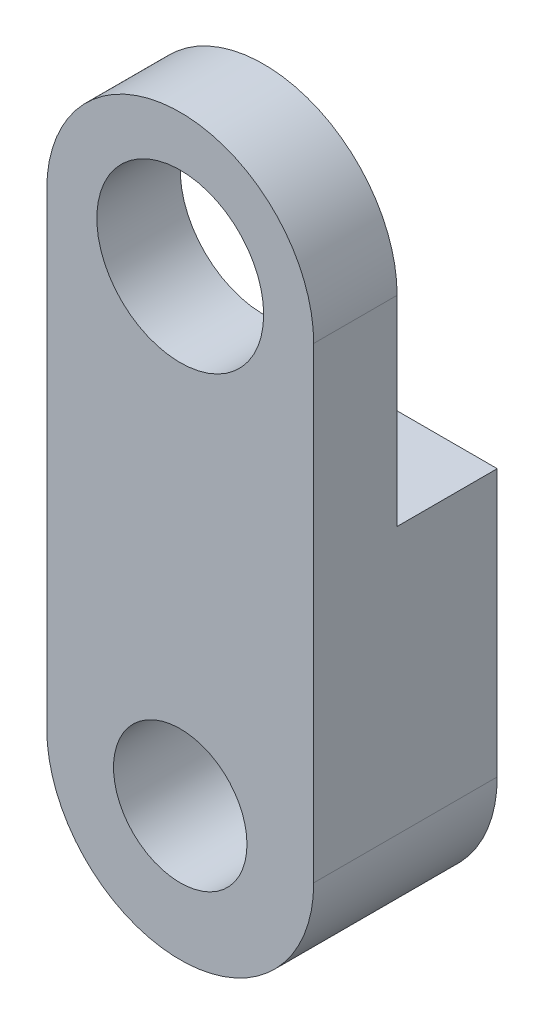
ISO-10303-21;
HEADER;
FILE_DESCRIPTION(('STEP AP214'),'2;1');
FILE_NAME('part.step','',(''),(''),'','','');
FILE_SCHEMA(('AUTOMOTIVE_DESIGN { 1 0 10303 214 1 1 1 1 }'));
ENDSEC;
DATA;
#1=APPLICATION_CONTEXT('core data for automotive mechanical design processes');
#2=APPLICATION_PROTOCOL_DEFINITION('international standard','automotive_design',2000,#1);
#3=PRODUCT_CONTEXT('',#1,'mechanical');
#4=PRODUCT('Part','Part','',(#3));
#5=PRODUCT_RELATED_PRODUCT_CATEGORY('part','',(#4));
#6=PRODUCT_DEFINITION_FORMATION('','',#4);
#7=PRODUCT_DEFINITION_CONTEXT('part definition',#1,'design');
#8=PRODUCT_DEFINITION('design','',#6,#7);
#9=PRODUCT_DEFINITION_SHAPE('','',#8);
#10=(LENGTH_UNIT() NAMED_UNIT(*) SI_UNIT(.MILLI.,.METRE.));
#11=(NAMED_UNIT(*) PLANE_ANGLE_UNIT() SI_UNIT($,.RADIAN.));
#12=(NAMED_UNIT(*) SI_UNIT($,.STERADIAN.) SOLID_ANGLE_UNIT());
#13=UNCERTAINTY_MEASURE_WITH_UNIT(LENGTH_MEASURE(1.E-05),#10,'distance_accuracy_value','');
#14=(GEOMETRIC_REPRESENTATION_CONTEXT(3) GLOBAL_UNCERTAINTY_ASSIGNED_CONTEXT((#13)) GLOBAL_UNIT_ASSIGNED_CONTEXT((#10,
#11,#12)) REPRESENTATION_CONTEXT('',''));
#15=CARTESIAN_POINT('',(0.,0.,0.));
#16=DIRECTION('',(0.,0.,1.));
#17=DIRECTION('',(1.,0.,0.));
#18=AXIS2_PLACEMENT_3D('',#15,#16,#17);
#19=CARTESIAN_POINT('',(0.,-7.,5.5));
#20=DIRECTION('',(0.,0.,1.));
#21=DIRECTION('',(1.,0.,0.));
#22=AXIS2_PLACEMENT_3D('',#19,#20,#21);
#23=PLANE('',#22);
#24=CARTESIAN_POINT('',(0.,-7.,5.5));
#25=DIRECTION('',(0.,0.,1.));
#26=DIRECTION('',(1.,0.,0.));
#27=AXIS2_PLACEMENT_3D('',#24,#25,#26);
#28=CIRCLE('',#27,2.);
#29=CARTESIAN_POINT('',(2.,-7.,5.5));
#30=VERTEX_POINT('',#29);
#31=EDGE_CURVE('E123',#30,#30,#28,.T.);
#32=ORIENTED_EDGE('',*,*,#31,.F.);
#33=EDGE_LOOP('',(#32));
#34=FACE_BOUND('',#33,.T.);
#35=CARTESIAN_POINT('',(0.,-7.,5.5));
#36=DIRECTION('',(0.,0.,1.));
#37=DIRECTION('',(1.,0.,0.));
#38=AXIS2_PLACEMENT_3D('',#35,#36,#37);
#39=CIRCLE('',#38,4.);
#40=CARTESIAN_POINT('',(-4.,-7.,5.5));
#41=VERTEX_POINT('',#40);
#42=CARTESIAN_POINT('',(4.,-7.,5.5));
#43=VERTEX_POINT('',#42);
#44=EDGE_CURVE('E129',#41,#43,#39,.T.);
#45=ORIENTED_EDGE('',*,*,#44,.T.);
#46=DIRECTION('',(0.,1.,0.));
#47=VECTOR('',#46,1.);
#48=CARTESIAN_POINT('',(4.,-7.,5.5));
#49=LINE('',#48,#47);
#50=CARTESIAN_POINT('',(4.,7.,5.5));
#51=VERTEX_POINT('',#50);
#52=EDGE_CURVE('E79',#43,#51,#49,.T.);
#53=ORIENTED_EDGE('',*,*,#52,.T.);
#54=CARTESIAN_POINT('',(0.,7.,5.5));
#55=DIRECTION('',(0.,0.,1.));
#56=DIRECTION('',(1.,0.,0.));
#57=AXIS2_PLACEMENT_3D('',#54,#55,#56);
#58=CIRCLE('',#57,4.);
#59=CARTESIAN_POINT('',(-4.,7.,5.5));
#60=VERTEX_POINT('',#59);
#61=EDGE_CURVE('E132',#51,#60,#58,.T.);
#62=ORIENTED_EDGE('',*,*,#61,.T.);
#63=DIRECTION('',(0.,-1.,0.));
#64=VECTOR('',#63,1.);
#65=CARTESIAN_POINT('',(-4.,-7.,5.5));
#66=LINE('',#65,#64);
#67=EDGE_CURVE('E58',#60,#41,#66,.T.);
#68=ORIENTED_EDGE('',*,*,#67,.T.);
#69=EDGE_LOOP('',(#45,#53,#62,#68));
#70=FACE_BOUND('',#69,.T.);
#71=CARTESIAN_POINT('',(0.,7.,5.5));
#72=DIRECTION('',(0.,0.,1.));
#73=DIRECTION('',(1.,0.,0.));
#74=AXIS2_PLACEMENT_3D('',#71,#72,#73);
#75=CIRCLE('',#74,2.5);
#76=CARTESIAN_POINT('',(2.5,7.,5.5));
#77=VERTEX_POINT('',#76);
#78=EDGE_CURVE('E119',#77,#77,#75,.T.);
#79=ORIENTED_EDGE('',*,*,#78,.F.);
#80=EDGE_LOOP('',(#79));
#81=FACE_BOUND('',#80,.T.);
#82=ADVANCED_FACE('F33',(#34,#70,#81),#23,.T.);
#83=CARTESIAN_POINT('',(0.,-7.,0.));
#84=DIRECTION('',(0.,0.,1.));
#85=DIRECTION('',(1.,0.,0.));
#86=AXIS2_PLACEMENT_3D('',#83,#84,#85);
#87=PLANE('',#86);
#88=DIRECTION('',(0.,-1.,0.));
#89=VECTOR('',#88,1.);
#90=CARTESIAN_POINT('',(-4.,-7.,0.));
#91=LINE('',#90,#89);
#92=CARTESIAN_POINT('',(-4.,0.999999999999997,0.));
#93=VERTEX_POINT('',#92);
#94=CARTESIAN_POINT('',(-4.,-7.,0.));
#95=VERTEX_POINT('',#94);
#96=EDGE_CURVE('E72',#93,#95,#91,.T.);
#97=ORIENTED_EDGE('',*,*,#96,.F.);
#98=DIRECTION('',(1.,0.,0.));
#99=VECTOR('',#98,1.);
#100=CARTESIAN_POINT('',(-4.,1.,0.));
#101=LINE('',#100,#99);
#102=CARTESIAN_POINT('',(4.,1.,0.));
#103=VERTEX_POINT('',#102);
#104=EDGE_CURVE('E49',#93,#103,#101,.T.);
#105=ORIENTED_EDGE('',*,*,#104,.T.);
#106=DIRECTION('',(0.,1.,0.));
#107=VECTOR('',#106,1.);
#108=CARTESIAN_POINT('',(4.,-7.,0.));
#109=LINE('',#108,#107);
#110=CARTESIAN_POINT('',(4.,-7.,0.));
#111=VERTEX_POINT('',#110);
#112=EDGE_CURVE('E111',#111,#103,#109,.T.);
#113=ORIENTED_EDGE('',*,*,#112,.F.);
#114=CARTESIAN_POINT('',(0.,-7.,0.));
#115=DIRECTION('',(0.,0.,1.));
#116=DIRECTION('',(1.,0.,0.));
#117=AXIS2_PLACEMENT_3D('',#114,#115,#116);
#118=CIRCLE('',#117,4.);
#119=EDGE_CURVE('E126',#95,#111,#118,.T.);
#120=ORIENTED_EDGE('',*,*,#119,.F.);
#121=EDGE_LOOP('',(#97,#105,#113,#120));
#122=FACE_BOUND('',#121,.T.);
#123=CARTESIAN_POINT('',(0.,-7.,0.));
#124=DIRECTION('',(0.,0.,1.));
#125=DIRECTION('',(1.,0.,0.));
#126=AXIS2_PLACEMENT_3D('',#123,#124,#125);
#127=CIRCLE('',#126,2.);
#128=CARTESIAN_POINT('',(2.,-7.,0.));
#129=VERTEX_POINT('',#128);
#130=EDGE_CURVE('E122',#129,#129,#127,.T.);
#131=ORIENTED_EDGE('',*,*,#130,.T.);
#132=EDGE_LOOP('',(#131));
#133=FACE_BOUND('',#132,.T.);
#134=ADVANCED_FACE('F154',(#122,#133),#87,.F.);
#135=CARTESIAN_POINT('',(0.,-7.,5.5));
#136=DIRECTION('',(0.,0.,-1.));
#137=DIRECTION('',(-1.,0.,0.));
#138=AXIS2_PLACEMENT_3D('',#135,#136,#137);
#139=CYLINDRICAL_SURFACE('',#138,4.);
#140=ORIENTED_EDGE('',*,*,#119,.T.);
#141=DIRECTION('',(0.,0.,-1.));
#142=VECTOR('',#141,1.);
#143=CARTESIAN_POINT('',(4.,-7.,5.5));
#144=LINE('',#143,#142);
#145=EDGE_CURVE('E11',#43,#111,#144,.T.);
#146=ORIENTED_EDGE('',*,*,#145,.F.);
#147=ORIENTED_EDGE('',*,*,#44,.F.);
#148=DIRECTION('',(0.,0.,-1.));
#149=VECTOR('',#148,1.);
#150=CARTESIAN_POINT('',(-4.,-7.,5.5));
#151=LINE('',#150,#149);
#152=EDGE_CURVE('E135',#41,#95,#151,.T.);
#153=ORIENTED_EDGE('',*,*,#152,.T.);
#154=EDGE_LOOP('',(#140,#146,#147,#153));
#155=FACE_BOUND('',#154,.T.);
#156=ADVANCED_FACE('F35',(#155),#139,.T.);
#157=CARTESIAN_POINT('',(4.,-7.,5.5));
#158=DIRECTION('',(-1.,0.,0.));
#159=DIRECTION('',(0.,-1.,0.));
#160=AXIS2_PLACEMENT_3D('',#157,#158,#159);
#161=PLANE('',#160);
#162=DIRECTION('',(0.,0.,-1.));
#163=VECTOR('',#162,1.);
#164=CARTESIAN_POINT('',(4.,1.,3.));
#165=LINE('',#164,#163);
#166=CARTESIAN_POINT('',(4.,1.,3.));
#167=VERTEX_POINT('',#166);
#168=EDGE_CURVE('E103',#167,#103,#165,.T.);
#169=ORIENTED_EDGE('',*,*,#168,.F.);
#170=DIRECTION('',(0.,-1.,0.));
#171=VECTOR('',#170,1.);
#172=CARTESIAN_POINT('',(4.,1.,3.));
#173=LINE('',#172,#171);
#174=CARTESIAN_POINT('',(4.,7.,3.));
#175=VERTEX_POINT('',#174);
#176=EDGE_CURVE('E95',#175,#167,#173,.T.);
#177=ORIENTED_EDGE('',*,*,#176,.F.);
#178=DIRECTION('',(0.,0.,-1.));
#179=VECTOR('',#178,1.);
#180=CARTESIAN_POINT('',(4.,7.,5.5));
#181=LINE('',#180,#179);
#182=EDGE_CURVE('E42',#51,#175,#181,.T.);
#183=ORIENTED_EDGE('',*,*,#182,.F.);
#184=ORIENTED_EDGE('',*,*,#52,.F.);
#185=ORIENTED_EDGE('',*,*,#145,.T.);
#186=ORIENTED_EDGE('',*,*,#112,.T.);
#187=EDGE_LOOP('',(#169,#177,#183,#184,#185,#186));
#188=FACE_BOUND('',#187,.T.);
#189=ADVANCED_FACE('F110',(#188),#161,.F.);
#190=CARTESIAN_POINT('',(0.,7.,5.5));
#191=DIRECTION('',(0.,0.,-1.));
#192=DIRECTION('',(-1.,0.,0.));
#193=AXIS2_PLACEMENT_3D('',#190,#191,#192);
#194=CYLINDRICAL_SURFACE('',#193,4.);
#195=ORIENTED_EDGE('',*,*,#182,.T.);
#196=CARTESIAN_POINT('',(0.,7.,3.));
#197=DIRECTION('',(0.,0.,1.));
#198=DIRECTION('',(1.,0.,0.));
#199=AXIS2_PLACEMENT_3D('',#196,#197,#198);
#200=CIRCLE('',#199,4.);
#201=CARTESIAN_POINT('',(-4.,7.,3.));
#202=VERTEX_POINT('',#201);
#203=EDGE_CURVE('E100',#175,#202,#200,.T.);
#204=ORIENTED_EDGE('',*,*,#203,.T.);
#205=DIRECTION('',(0.,0.,-1.));
#206=VECTOR('',#205,1.);
#207=CARTESIAN_POINT('',(-4.,7.,5.5));
#208=LINE('',#207,#206);
#209=EDGE_CURVE('E141',#60,#202,#208,.T.);
#210=ORIENTED_EDGE('',*,*,#209,.F.);
#211=ORIENTED_EDGE('',*,*,#61,.F.);
#212=EDGE_LOOP('',(#195,#204,#210,#211));
#213=FACE_BOUND('',#212,.T.);
#214=ADVANCED_FACE('F146',(#213),#194,.T.);
#215=CARTESIAN_POINT('',(-4.,-7.,5.5));
#216=DIRECTION('',(1.,0.,0.));
#217=DIRECTION('',(0.,1.,0.));
#218=AXIS2_PLACEMENT_3D('',#215,#216,#217);
#219=PLANE('',#218);
#220=ORIENTED_EDGE('',*,*,#209,.T.);
#221=DIRECTION('',(0.,-1.,0.));
#222=VECTOR('',#221,1.);
#223=CARTESIAN_POINT('',(-4.,1.,3.));
#224=LINE('',#223,#222);
#225=CARTESIAN_POINT('',(-4.,1.,3.));
#226=VERTEX_POINT('',#225);
#227=EDGE_CURVE('E112',#202,#226,#224,.T.);
#228=ORIENTED_EDGE('',*,*,#227,.T.);
#229=DIRECTION('',(0.,0.,-1.));
#230=VECTOR('',#229,1.);
#231=CARTESIAN_POINT('',(-4.,1.,3.));
#232=LINE('',#231,#230);
#233=EDGE_CURVE('E106',#226,#93,#232,.T.);
#234=ORIENTED_EDGE('',*,*,#233,.T.);
#235=ORIENTED_EDGE('',*,*,#96,.T.);
#236=ORIENTED_EDGE('',*,*,#152,.F.);
#237=ORIENTED_EDGE('',*,*,#67,.F.);
#238=EDGE_LOOP('',(#220,#228,#234,#235,#236,#237));
#239=FACE_BOUND('',#238,.T.);
#240=ADVANCED_FACE('F163',(#239),#219,.F.);
#241=CARTESIAN_POINT('',(0.,-7.,5.5));
#242=DIRECTION('',(0.,0.,-1.));
#243=DIRECTION('',(-1.,0.,0.));
#244=AXIS2_PLACEMENT_3D('',#241,#242,#243);
#245=CYLINDRICAL_SURFACE('',#244,2.);
#246=ORIENTED_EDGE('',*,*,#31,.T.);
#247=EDGE_LOOP('',(#246));
#248=FACE_BOUND('',#247,.T.);
#249=ORIENTED_EDGE('',*,*,#130,.F.);
#250=EDGE_LOOP('',(#249));
#251=FACE_BOUND('',#250,.T.);
#252=ADVANCED_FACE('F160',(#248,#251),#245,.F.);
#253=CARTESIAN_POINT('',(0.,7.,5.5));
#254=DIRECTION('',(0.,0.,-1.));
#255=DIRECTION('',(-1.,0.,0.));
#256=AXIS2_PLACEMENT_3D('',#253,#254,#255);
#257=CYLINDRICAL_SURFACE('',#256,2.5);
#258=CARTESIAN_POINT('',(0.,7.,3.));
#259=DIRECTION('',(0.,0.,1.));
#260=DIRECTION('',(1.,0.,0.));
#261=AXIS2_PLACEMENT_3D('',#258,#259,#260);
#262=CIRCLE('',#261,2.5);
#263=CARTESIAN_POINT('',(2.5,7.,3.));
#264=VERTEX_POINT('',#263);
#265=EDGE_CURVE('E37',#264,#264,#262,.T.);
#266=ORIENTED_EDGE('',*,*,#265,.F.);
#267=EDGE_LOOP('',(#266));
#268=FACE_BOUND('',#267,.T.);
#269=ORIENTED_EDGE('',*,*,#78,.T.);
#270=EDGE_LOOP('',(#269));
#271=FACE_BOUND('',#270,.T.);
#272=ADVANCED_FACE('F162',(#268,#271),#257,.F.);
#273=CARTESIAN_POINT('',(-4.,1.,3.));
#274=DIRECTION('',(0.,0.,1.));
#275=DIRECTION('',(1.,0.,0.));
#276=AXIS2_PLACEMENT_3D('',#273,#274,#275);
#277=PLANE('',#276);
#278=ORIENTED_EDGE('',*,*,#265,.T.);
#279=EDGE_LOOP('',(#278));
#280=FACE_BOUND('',#279,.T.);
#281=ORIENTED_EDGE('',*,*,#176,.T.);
#282=DIRECTION('',(1.,0.,0.));
#283=VECTOR('',#282,1.);
#284=CARTESIAN_POINT('',(-4.,1.,3.));
#285=LINE('',#284,#283);
#286=EDGE_CURVE('E99',#226,#167,#285,.T.);
#287=ORIENTED_EDGE('',*,*,#286,.F.);
#288=ORIENTED_EDGE('',*,*,#227,.F.);
#289=ORIENTED_EDGE('',*,*,#203,.F.);
#290=EDGE_LOOP('',(#281,#287,#288,#289));
#291=FACE_BOUND('',#290,.T.);
#292=ADVANCED_FACE('F97',(#280,#291),#277,.F.);
#293=CARTESIAN_POINT('',(-4.,1.,3.));
#294=DIRECTION('',(0.,-1.,0.));
#295=DIRECTION('',(0.,0.,-1.));
#296=AXIS2_PLACEMENT_3D('',#293,#294,#295);
#297=PLANE('',#296);
#298=ORIENTED_EDGE('',*,*,#104,.F.);
#299=ORIENTED_EDGE('',*,*,#233,.F.);
#300=ORIENTED_EDGE('',*,*,#286,.T.);
#301=ORIENTED_EDGE('',*,*,#168,.T.);
#302=EDGE_LOOP('',(#298,#299,#300,#301));
#303=FACE_BOUND('',#302,.T.);
#304=ADVANCED_FACE('F105',(#303),#297,.F.);
#305=CLOSED_SHELL('',(#82,#134,#156,#189,#214,#240,#252,#272,#292,#304));
#306=MANIFOLD_SOLID_BREP('B2',#305);
#307=ADVANCED_BREP_SHAPE_REPRESENTATION('',(#18,#306),#14);
#308=SHAPE_DEFINITION_REPRESENTATION(#9,#307);
ENDSEC;
END-ISO-10303-21;
